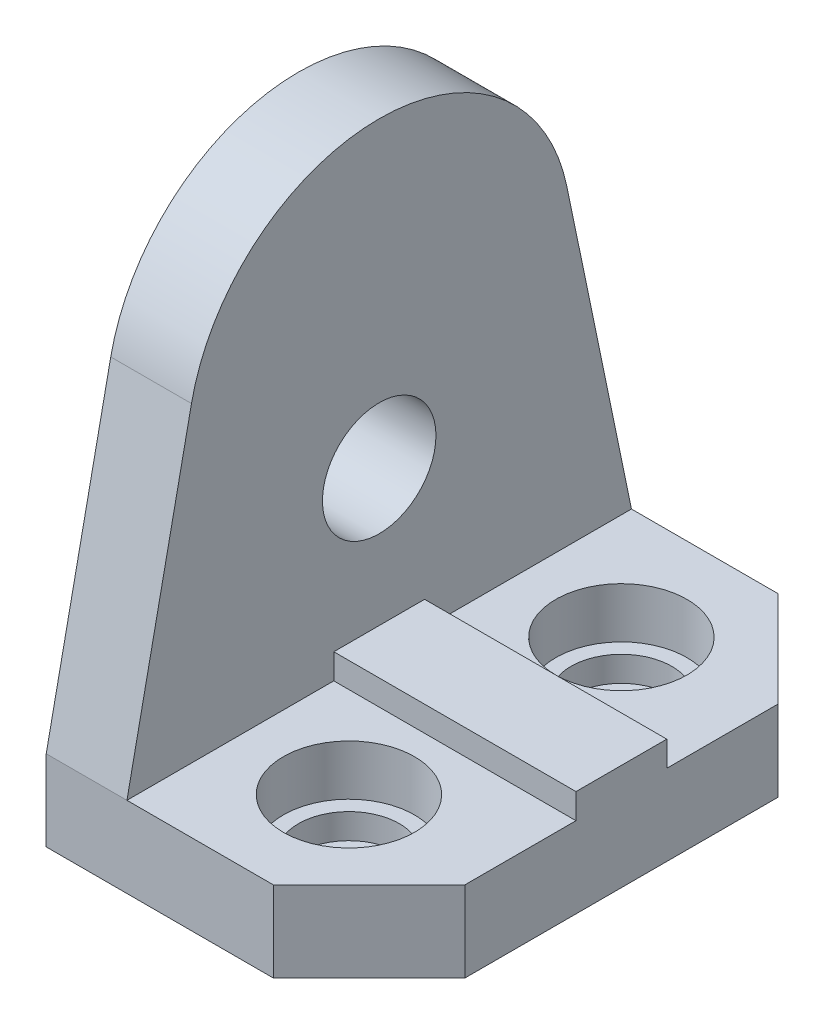
ISO-10303-21;
HEADER;
FILE_DESCRIPTION(('STEP AP214'),'2;1');
FILE_NAME('part.step','',(''),(''),'','','');
FILE_SCHEMA(('AUTOMOTIVE_DESIGN { 1 0 10303 214 1 1 1 1 }'));
ENDSEC;
DATA;
#1=APPLICATION_CONTEXT('core data for automotive mechanical design processes');
#2=APPLICATION_PROTOCOL_DEFINITION('international standard','automotive_design',2000,#1);
#3=PRODUCT_CONTEXT('',#1,'mechanical');
#4=PRODUCT('Part','Part','',(#3));
#5=PRODUCT_RELATED_PRODUCT_CATEGORY('part','',(#4));
#6=PRODUCT_DEFINITION_FORMATION('','',#4);
#7=PRODUCT_DEFINITION_CONTEXT('part definition',#1,'design');
#8=PRODUCT_DEFINITION('design','',#6,#7);
#9=PRODUCT_DEFINITION_SHAPE('','',#8);
#10=(LENGTH_UNIT() NAMED_UNIT(*) SI_UNIT(.MILLI.,.METRE.));
#11=(NAMED_UNIT(*) PLANE_ANGLE_UNIT() SI_UNIT($,.RADIAN.));
#12=(NAMED_UNIT(*) SI_UNIT($,.STERADIAN.) SOLID_ANGLE_UNIT());
#13=UNCERTAINTY_MEASURE_WITH_UNIT(LENGTH_MEASURE(1.E-05),#10,'distance_accuracy_value','');
#14=(GEOMETRIC_REPRESENTATION_CONTEXT(3) GLOBAL_UNCERTAINTY_ASSIGNED_CONTEXT((#13)) GLOBAL_UNIT_ASSIGNED_CONTEXT((#10,
#11,#12)) REPRESENTATION_CONTEXT('',''));
#15=CARTESIAN_POINT('',(0.,0.,0.));
#16=DIRECTION('',(0.,0.,1.));
#17=DIRECTION('',(1.,0.,0.));
#18=AXIS2_PLACEMENT_3D('',#15,#16,#17);
#19=CARTESIAN_POINT('',(0.,32.,0.));
#20=DIRECTION('',(0.,1.,0.));
#21=DIRECTION('',(0.,0.,1.));
#22=AXIS2_PLACEMENT_3D('',#19,#20,#21);
#23=PLANE('',#22);
#24=CARTESIAN_POINT('',(74.,32.,54.));
#25=DIRECTION('',(0.,1.,0.));
#26=DIRECTION('',(0.,0.,1.));
#27=AXIS2_PLACEMENT_3D('',#24,#25,#26);
#28=CIRCLE('',#27,26.);
#29=CARTESIAN_POINT('',(74.,32.,80.));
#30=VERTEX_POINT('',#29);
#31=EDGE_CURVE('E133',#30,#30,#28,.T.);
#32=ORIENTED_EDGE('',*,*,#31,.F.);
#33=EDGE_LOOP('',(#32));
#34=FACE_BOUND('',#33,.T.);
#35=DIRECTION('',(1.,0.,0.));
#36=VECTOR('',#35,1.);
#37=CARTESIAN_POINT('',(0.,32.,18.));
#38=LINE('',#37,#36);
#39=CARTESIAN_POINT('',(32.,32.,18.));
#40=VERTEX_POINT('',#39);
#41=CARTESIAN_POINT('',(128.,32.,18.));
#42=VERTEX_POINT('',#41);
#43=EDGE_CURVE('E113',#40,#42,#38,.T.);
#44=ORIENTED_EDGE('',*,*,#43,.F.);
#45=DIRECTION('',(0.,0.,-1.));
#46=VECTOR('',#45,1.);
#47=CARTESIAN_POINT('',(32.,32.,100.));
#48=LINE('',#47,#46);
#49=CARTESIAN_POINT('',(32.,32.,100.));
#50=VERTEX_POINT('',#49);
#51=EDGE_CURVE('E167',#50,#40,#48,.T.);
#52=ORIENTED_EDGE('',*,*,#51,.F.);
#53=DIRECTION('',(1.,0.,0.));
#54=VECTOR('',#53,1.);
#55=CARTESIAN_POINT('',(0.,32.,100.));
#56=LINE('',#55,#54);
#57=CARTESIAN_POINT('',(90.,32.,100.));
#58=VERTEX_POINT('',#57);
#59=EDGE_CURVE('E117',#50,#58,#56,.T.);
#60=ORIENTED_EDGE('',*,*,#59,.T.);
#61=DIRECTION('',(0.707106781186548,0.,-0.707106781186547));
#62=VECTOR('',#61,1.);
#63=CARTESIAN_POINT('',(95.,32.,95.0000000000001));
#64=LINE('',#63,#62);
#65=CARTESIAN_POINT('',(128.,32.,62.));
#66=VERTEX_POINT('',#65);
#67=EDGE_CURVE('E66',#58,#66,#64,.T.);
#68=ORIENTED_EDGE('',*,*,#67,.T.);
#69=DIRECTION('',(0.,0.,1.));
#70=VECTOR('',#69,1.);
#71=CARTESIAN_POINT('',(128.,32.,0.));
#72=LINE('',#71,#70);
#73=EDGE_CURVE('E91',#42,#66,#72,.T.);
#74=ORIENTED_EDGE('',*,*,#73,.F.);
#75=EDGE_LOOP('',(#44,#52,#60,#68,#74));
#76=FACE_BOUND('',#75,.T.);
#77=ADVANCED_FACE('F39',(#34,#76),#23,.T.);
#78=CARTESIAN_POINT('',(0.,42.,18.));
#79=DIRECTION('',(0.,0.,-1.));
#80=DIRECTION('',(-1.,0.,0.));
#81=AXIS2_PLACEMENT_3D('',#78,#79,#80);
#82=PLANE('',#81);
#83=DIRECTION('',(0.,1.,0.));
#84=VECTOR('',#83,1.);
#85=CARTESIAN_POINT('',(32.,42.,18.));
#86=LINE('',#85,#84);
#87=CARTESIAN_POINT('',(32.,42.,18.));
#88=VERTEX_POINT('',#87);
#89=EDGE_CURVE('E208',#40,#88,#86,.T.);
#90=ORIENTED_EDGE('',*,*,#89,.F.);
#91=ORIENTED_EDGE('',*,*,#43,.T.);
#92=DIRECTION('',(0.,-1.,0.));
#93=VECTOR('',#92,1.);
#94=CARTESIAN_POINT('',(128.,42.,18.));
#95=LINE('',#94,#93);
#96=CARTESIAN_POINT('',(128.,42.,18.));
#97=VERTEX_POINT('',#96);
#98=EDGE_CURVE('E261',#97,#42,#95,.T.);
#99=ORIENTED_EDGE('',*,*,#98,.F.);
#100=DIRECTION('',(1.,0.,0.));
#101=VECTOR('',#100,1.);
#102=CARTESIAN_POINT('',(0.,42.,18.));
#103=LINE('',#102,#101);
#104=EDGE_CURVE('E249',#88,#97,#103,.T.);
#105=ORIENTED_EDGE('',*,*,#104,.F.);
#106=EDGE_LOOP('',(#90,#91,#99,#105));
#107=FACE_BOUND('',#106,.T.);
#108=ADVANCED_FACE('F311',(#107),#82,.F.);
#109=CARTESIAN_POINT('',(0.,42.,-18.));
#110=DIRECTION('',(0.,0.,-1.));
#111=DIRECTION('',(-1.,0.,0.));
#112=AXIS2_PLACEMENT_3D('',#109,#110,#111);
#113=PLANE('',#112);
#114=DIRECTION('',(1.,0.,0.));
#115=VECTOR('',#114,1.);
#116=CARTESIAN_POINT('',(0.,32.,-18.));
#117=LINE('',#116,#115);
#118=CARTESIAN_POINT('',(32.,32.,-18.));
#119=VERTEX_POINT('',#118);
#120=CARTESIAN_POINT('',(128.,32.,-18.));
#121=VERTEX_POINT('',#120);
#122=EDGE_CURVE('E212',#119,#121,#117,.T.);
#123=ORIENTED_EDGE('',*,*,#122,.F.);
#124=DIRECTION('',(0.,1.,0.));
#125=VECTOR('',#124,1.);
#126=CARTESIAN_POINT('',(32.,42.,-18.));
#127=LINE('',#126,#125);
#128=CARTESIAN_POINT('',(32.,42.,-18.));
#129=VERTEX_POINT('',#128);
#130=EDGE_CURVE('E204',#119,#129,#127,.T.);
#131=ORIENTED_EDGE('',*,*,#130,.T.);
#132=DIRECTION('',(1.,0.,0.));
#133=VECTOR('',#132,1.);
#134=CARTESIAN_POINT('',(0.,42.,-18.));
#135=LINE('',#134,#133);
#136=CARTESIAN_POINT('',(128.,42.,-18.));
#137=VERTEX_POINT('',#136);
#138=EDGE_CURVE('E245',#129,#137,#135,.T.);
#139=ORIENTED_EDGE('',*,*,#138,.T.);
#140=DIRECTION('',(0.,-1.,0.));
#141=VECTOR('',#140,1.);
#142=CARTESIAN_POINT('',(128.,42.,-18.));
#143=LINE('',#142,#141);
#144=EDGE_CURVE('E257',#137,#121,#143,.T.);
#145=ORIENTED_EDGE('',*,*,#144,.T.);
#146=EDGE_LOOP('',(#123,#131,#139,#145));
#147=FACE_BOUND('',#146,.T.);
#148=ADVANCED_FACE('F340',(#147),#113,.T.);
#149=CARTESIAN_POINT('',(0.,42.,0.));
#150=DIRECTION('',(0.,1.,0.));
#151=DIRECTION('',(0.,0.,1.));
#152=AXIS2_PLACEMENT_3D('',#149,#150,#151);
#153=PLANE('',#152);
#154=ORIENTED_EDGE('',*,*,#138,.F.);
#155=DIRECTION('',(0.,0.,1.));
#156=VECTOR('',#155,1.);
#157=CARTESIAN_POINT('',(32.,42.,0.));
#158=LINE('',#157,#156);
#159=EDGE_CURVE('E200',#129,#88,#158,.T.);
#160=ORIENTED_EDGE('',*,*,#159,.T.);
#161=ORIENTED_EDGE('',*,*,#104,.T.);
#162=DIRECTION('',(0.,0.,1.));
#163=VECTOR('',#162,1.);
#164=CARTESIAN_POINT('',(128.,42.,0.));
#165=LINE('',#164,#163);
#166=EDGE_CURVE('E253',#137,#97,#165,.T.);
#167=ORIENTED_EDGE('',*,*,#166,.F.);
#168=EDGE_LOOP('',(#154,#160,#161,#167));
#169=FACE_BOUND('',#168,.T.);
#170=ADVANCED_FACE('F319',(#169),#153,.T.);
#171=CARTESIAN_POINT('',(0.,32.,0.));
#172=DIRECTION('',(0.,1.,0.));
#173=DIRECTION('',(0.,0.,1.));
#174=AXIS2_PLACEMENT_3D('',#171,#172,#173);
#175=PLANE('',#174);
#176=CARTESIAN_POINT('',(74.,32.,-54.));
#177=DIRECTION('',(0.,1.,0.));
#178=DIRECTION('',(0.,0.,1.));
#179=AXIS2_PLACEMENT_3D('',#176,#177,#178);
#180=CIRCLE('',#179,26.);
#181=CARTESIAN_POINT('',(74.,32.,-28.));
#182=VERTEX_POINT('',#181);
#183=EDGE_CURVE('E148',#182,#182,#180,.T.);
#184=ORIENTED_EDGE('',*,*,#183,.F.);
#185=EDGE_LOOP('',(#184));
#186=FACE_BOUND('',#185,.T.);
#187=DIRECTION('',(1.,0.,0.));
#188=VECTOR('',#187,1.);
#189=CARTESIAN_POINT('',(0.,32.,-100.));
#190=LINE('',#189,#188);
#191=CARTESIAN_POINT('',(32.,32.,-100.));
#192=VERTEX_POINT('',#191);
#193=CARTESIAN_POINT('',(90.,32.,-100.));
#194=VERTEX_POINT('',#193);
#195=EDGE_CURVE('E225',#192,#194,#190,.T.);
#196=ORIENTED_EDGE('',*,*,#195,.F.);
#197=DIRECTION('',(0.,0.,1.));
#198=VECTOR('',#197,1.);
#199=CARTESIAN_POINT('',(32.,32.,0.));
#200=LINE('',#199,#198);
#201=EDGE_CURVE('E11',#192,#119,#200,.T.);
#202=ORIENTED_EDGE('',*,*,#201,.T.);
#203=ORIENTED_EDGE('',*,*,#122,.T.);
#204=DIRECTION('',(0.,0.,1.));
#205=VECTOR('',#204,1.);
#206=CARTESIAN_POINT('',(128.,32.,0.));
#207=LINE('',#206,#205);
#208=CARTESIAN_POINT('',(128.,32.,-62.));
#209=VERTEX_POINT('',#208);
#210=EDGE_CURVE('E216',#209,#121,#207,.T.);
#211=ORIENTED_EDGE('',*,*,#210,.F.);
#212=DIRECTION('',(0.707106781186548,0.,0.707106781186547));
#213=VECTOR('',#212,1.);
#214=CARTESIAN_POINT('',(95.,32.,-95.0000000000001));
#215=LINE('',#214,#213);
#216=EDGE_CURVE('E221',#194,#209,#215,.T.);
#217=ORIENTED_EDGE('',*,*,#216,.F.);
#218=EDGE_LOOP('',(#196,#202,#203,#211,#217));
#219=FACE_BOUND('',#218,.T.);
#220=ADVANCED_FACE('F337',(#186,#219),#175,.T.);
#221=CARTESIAN_POINT('',(0.,32.,0.));
#222=DIRECTION('',(-1.,0.,0.));
#223=DIRECTION('',(0.,0.,1.));
#224=AXIS2_PLACEMENT_3D('',#221,#222,#223);
#225=PLANE('',#224);
#226=DIRECTION('',(0.,-1.,0.));
#227=VECTOR('',#226,1.);
#228=CARTESIAN_POINT('',(0.,32.,100.));
#229=LINE('',#228,#227);
#230=CARTESIAN_POINT('',(0.,32.,100.));
#231=VERTEX_POINT('',#230);
#232=CARTESIAN_POINT('',(0.,0.,100.));
#233=VERTEX_POINT('',#232);
#234=EDGE_CURVE('E49',#231,#233,#229,.T.);
#235=ORIENTED_EDGE('',*,*,#234,.F.);
#236=DIRECTION('',(0.,-0.979188602552283,0.202952409770633));
#237=VECTOR('',#236,1.);
#238=CARTESIAN_POINT('',(0.,32.,100.));
#239=LINE('',#238,#237);
#240=CARTESIAN_POINT('',(0.,155.424383142568,74.4183337939735));
#241=VERTEX_POINT('',#240);
#242=EDGE_CURVE('E171',#241,#231,#239,.T.);
#243=ORIENTED_EDGE('',*,*,#242,.F.);
#244=CARTESIAN_POINT('',(0.,140.,0.));
#245=DIRECTION('',(1.,0.,0.));
#246=DIRECTION('',(0.,0.,1.));
#247=AXIS2_PLACEMENT_3D('',#244,#245,#246);
#248=CIRCLE('',#247,76.);
#249=CARTESIAN_POINT('',(0.,155.424383142568,-74.4183337939735));
#250=VERTEX_POINT('',#249);
#251=EDGE_CURVE('E186',#250,#241,#248,.T.);
#252=ORIENTED_EDGE('',*,*,#251,.F.);
#253=DIRECTION('',(0.,0.979188602552283,0.202952409770633));
#254=VECTOR('',#253,1.);
#255=CARTESIAN_POINT('',(0.,155.424383142568,-74.4183337939735));
#256=LINE('',#255,#254);
#257=CARTESIAN_POINT('',(0.,32.,-100.));
#258=VERTEX_POINT('',#257);
#259=EDGE_CURVE('E163',#258,#250,#256,.T.);
#260=ORIENTED_EDGE('',*,*,#259,.F.);
#261=DIRECTION('',(0.,-1.,0.));
#262=VECTOR('',#261,1.);
#263=CARTESIAN_POINT('',(0.,32.,-100.));
#264=LINE('',#263,#262);
#265=CARTESIAN_POINT('',(0.,0.,-100.));
#266=VERTEX_POINT('',#265);
#267=EDGE_CURVE('E230',#258,#266,#264,.T.);
#268=ORIENTED_EDGE('',*,*,#267,.T.);
#269=DIRECTION('',(0.,0.,-1.));
#270=VECTOR('',#269,1.);
#271=CARTESIAN_POINT('',(0.,0.,0.));
#272=LINE('',#271,#270);
#273=EDGE_CURVE('E263',#233,#266,#272,.T.);
#274=ORIENTED_EDGE('',*,*,#273,.F.);
#275=EDGE_LOOP('',(#235,#243,#252,#260,#268,#274));
#276=FACE_BOUND('',#275,.T.);
#277=CARTESIAN_POINT('',(0.,96.,0.));
#278=DIRECTION('',(1.,0.,0.));
#279=DIRECTION('',(0.,0.,-1.));
#280=AXIS2_PLACEMENT_3D('',#277,#278,#279);
#281=CIRCLE('',#280,22.5);
#282=CARTESIAN_POINT('',(0.,96.,-22.5));
#283=VERTEX_POINT('',#282);
#284=EDGE_CURVE('E147',#283,#283,#281,.T.);
#285=ORIENTED_EDGE('',*,*,#284,.T.);
#286=EDGE_LOOP('',(#285));
#287=FACE_BOUND('',#286,.T.);
#288=ADVANCED_FACE('F41',(#276,#287),#225,.T.);
#289=CARTESIAN_POINT('',(0.,32.,100.));
#290=DIRECTION('',(0.,0.,-1.));
#291=DIRECTION('',(-1.,0.,0.));
#292=AXIS2_PLACEMENT_3D('',#289,#290,#291);
#293=PLANE('',#292);
#294=DIRECTION('',(1.,0.,0.));
#295=VECTOR('',#294,1.);
#296=CARTESIAN_POINT('',(0.,0.,100.));
#297=LINE('',#296,#295);
#298=CARTESIAN_POINT('',(90.,0.,100.));
#299=VERTEX_POINT('',#298);
#300=EDGE_CURVE('E104',#233,#299,#297,.T.);
#301=ORIENTED_EDGE('',*,*,#300,.T.);
#302=DIRECTION('',(0.,-1.,0.));
#303=VECTOR('',#302,1.);
#304=CARTESIAN_POINT('',(90.,32.,100.));
#305=LINE('',#304,#303);
#306=EDGE_CURVE('E94',#58,#299,#305,.T.);
#307=ORIENTED_EDGE('',*,*,#306,.F.);
#308=ORIENTED_EDGE('',*,*,#59,.F.);
#309=EDGE_CURVE('E265',#231,#50,#56,.T.);
#310=ORIENTED_EDGE('',*,*,#309,.F.);
#311=ORIENTED_EDGE('',*,*,#234,.T.);
#312=EDGE_LOOP('',(#301,#307,#308,#310,#311));
#313=FACE_BOUND('',#312,.T.);
#314=ADVANCED_FACE('F276',(#313),#293,.F.);
#315=CARTESIAN_POINT('',(95.,32.,95.0000000000001));
#316=DIRECTION('',(-0.707106781186547,0.,-0.707106781186548));
#317=DIRECTION('',(-0.707106781186548,0.,0.707106781186547));
#318=AXIS2_PLACEMENT_3D('',#315,#316,#317);
#319=PLANE('',#318);
#320=DIRECTION('',(0.707106781186548,0.,-0.707106781186547));
#321=VECTOR('',#320,1.);
#322=CARTESIAN_POINT('',(95.,0.,95.0000000000001));
#323=LINE('',#322,#321);
#324=CARTESIAN_POINT('',(128.,0.,62.));
#325=VERTEX_POINT('',#324);
#326=EDGE_CURVE('E98',#299,#325,#323,.T.);
#327=ORIENTED_EDGE('',*,*,#326,.T.);
#328=DIRECTION('',(0.,-1.,0.));
#329=VECTOR('',#328,1.);
#330=CARTESIAN_POINT('',(128.,32.,62.));
#331=LINE('',#330,#329);
#332=EDGE_CURVE('E82',#66,#325,#331,.T.);
#333=ORIENTED_EDGE('',*,*,#332,.F.);
#334=ORIENTED_EDGE('',*,*,#67,.F.);
#335=ORIENTED_EDGE('',*,*,#306,.T.);
#336=EDGE_LOOP('',(#327,#333,#334,#335));
#337=FACE_BOUND('',#336,.T.);
#338=ADVANCED_FACE('F99',(#337),#319,.F.);
#339=CARTESIAN_POINT('',(128.,32.,0.));
#340=DIRECTION('',(1.,0.,0.));
#341=DIRECTION('',(0.,0.,-1.));
#342=AXIS2_PLACEMENT_3D('',#339,#340,#341);
#343=PLANE('',#342);
#344=DIRECTION('',(0.,0.,1.));
#345=VECTOR('',#344,1.);
#346=CARTESIAN_POINT('',(128.,0.,0.));
#347=LINE('',#346,#345);
#348=CARTESIAN_POINT('',(128.,0.,-62.));
#349=VERTEX_POINT('',#348);
#350=EDGE_CURVE('E88',#349,#325,#347,.T.);
#351=ORIENTED_EDGE('',*,*,#350,.F.);
#352=DIRECTION('',(0.,-1.,0.));
#353=VECTOR('',#352,1.);
#354=CARTESIAN_POINT('',(128.,32.,-62.));
#355=LINE('',#354,#353);
#356=EDGE_CURVE('E242',#209,#349,#355,.T.);
#357=ORIENTED_EDGE('',*,*,#356,.F.);
#358=ORIENTED_EDGE('',*,*,#210,.T.);
#359=ORIENTED_EDGE('',*,*,#144,.F.);
#360=ORIENTED_EDGE('',*,*,#166,.T.);
#361=ORIENTED_EDGE('',*,*,#98,.T.);
#362=ORIENTED_EDGE('',*,*,#73,.T.);
#363=ORIENTED_EDGE('',*,*,#332,.T.);
#364=EDGE_LOOP('',(#351,#357,#358,#359,#360,#361,#362,#363));
#365=FACE_BOUND('',#364,.T.);
#366=ADVANCED_FACE('F84',(#365),#343,.T.);
#367=CARTESIAN_POINT('',(0.,0.,0.));
#368=DIRECTION('',(0.,1.,0.));
#369=DIRECTION('',(0.,0.,1.));
#370=AXIS2_PLACEMENT_3D('',#367,#368,#369);
#371=PLANE('',#370);
#372=ORIENTED_EDGE('',*,*,#273,.T.);
#373=DIRECTION('',(1.,0.,0.));
#374=VECTOR('',#373,1.);
#375=CARTESIAN_POINT('',(0.,0.,-100.));
#376=LINE('',#375,#374);
#377=CARTESIAN_POINT('',(90.,0.,-100.));
#378=VERTEX_POINT('',#377);
#379=EDGE_CURVE('E217',#266,#378,#376,.T.);
#380=ORIENTED_EDGE('',*,*,#379,.T.);
#381=DIRECTION('',(0.707106781186548,0.,0.707106781186547));
#382=VECTOR('',#381,1.);
#383=CARTESIAN_POINT('',(95.,0.,-95.0000000000001));
#384=LINE('',#383,#382);
#385=EDGE_CURVE('E111',#378,#349,#384,.T.);
#386=ORIENTED_EDGE('',*,*,#385,.T.);
#387=ORIENTED_EDGE('',*,*,#350,.T.);
#388=ORIENTED_EDGE('',*,*,#326,.F.);
#389=ORIENTED_EDGE('',*,*,#300,.F.);
#390=EDGE_LOOP('',(#372,#380,#386,#387,#388,#389));
#391=FACE_BOUND('',#390,.T.);
#392=ADVANCED_FACE('F108',(#391),#371,.F.);
#393=CARTESIAN_POINT('',(95.,32.,-95.0000000000001));
#394=DIRECTION('',(0.707106781186547,0.,-0.707106781186548));
#395=DIRECTION('',(-0.707106781186548,0.,-0.707106781186547));
#396=AXIS2_PLACEMENT_3D('',#393,#394,#395);
#397=PLANE('',#396);
#398=ORIENTED_EDGE('',*,*,#385,.F.);
#399=DIRECTION('',(0.,-1.,0.));
#400=VECTOR('',#399,1.);
#401=CARTESIAN_POINT('',(90.,32.,-100.));
#402=LINE('',#401,#400);
#403=EDGE_CURVE('E238',#194,#378,#402,.T.);
#404=ORIENTED_EDGE('',*,*,#403,.F.);
#405=ORIENTED_EDGE('',*,*,#216,.T.);
#406=ORIENTED_EDGE('',*,*,#356,.T.);
#407=EDGE_LOOP('',(#398,#404,#405,#406));
#408=FACE_BOUND('',#407,.T.);
#409=ADVANCED_FACE('F335',(#408),#397,.T.);
#410=CARTESIAN_POINT('',(0.,32.,-100.));
#411=DIRECTION('',(0.,0.,-1.));
#412=DIRECTION('',(-1.,0.,0.));
#413=AXIS2_PLACEMENT_3D('',#410,#411,#412);
#414=PLANE('',#413);
#415=ORIENTED_EDGE('',*,*,#379,.F.);
#416=ORIENTED_EDGE('',*,*,#267,.F.);
#417=EDGE_CURVE('E226',#258,#192,#190,.T.);
#418=ORIENTED_EDGE('',*,*,#417,.T.);
#419=ORIENTED_EDGE('',*,*,#195,.T.);
#420=ORIENTED_EDGE('',*,*,#403,.T.);
#421=EDGE_LOOP('',(#415,#416,#418,#419,#420));
#422=FACE_BOUND('',#421,.T.);
#423=ADVANCED_FACE('F295',(#422),#414,.T.);
#424=CARTESIAN_POINT('',(32.,140.,0.));
#425=DIRECTION('',(-1.,0.,0.));
#426=DIRECTION('',(0.,0.,1.));
#427=AXIS2_PLACEMENT_3D('',#424,#425,#426);
#428=PLANE('',#427);
#429=CARTESIAN_POINT('',(32.,96.,0.));
#430=DIRECTION('',(1.,0.,0.));
#431=DIRECTION('',(0.,0.,-1.));
#432=AXIS2_PLACEMENT_3D('',#429,#430,#431);
#433=CIRCLE('',#432,22.5);
#434=CARTESIAN_POINT('',(32.,96.,-22.5));
#435=VERTEX_POINT('',#434);
#436=EDGE_CURVE('E159',#435,#435,#433,.T.);
#437=ORIENTED_EDGE('',*,*,#436,.F.);
#438=EDGE_LOOP('',(#437));
#439=FACE_BOUND('',#438,.T.);
#440=ORIENTED_EDGE('',*,*,#51,.T.);
#441=ORIENTED_EDGE('',*,*,#89,.T.);
#442=ORIENTED_EDGE('',*,*,#159,.F.);
#443=ORIENTED_EDGE('',*,*,#130,.F.);
#444=ORIENTED_EDGE('',*,*,#201,.F.);
#445=DIRECTION('',(0.,0.979188602552283,0.202952409770633));
#446=VECTOR('',#445,1.);
#447=CARTESIAN_POINT('',(32.,155.424383142568,-74.4183337939735));
#448=LINE('',#447,#446);
#449=CARTESIAN_POINT('',(32.,155.424383142568,-74.4183337939735));
#450=VERTEX_POINT('',#449);
#451=EDGE_CURVE('E57',#192,#450,#448,.T.);
#452=ORIENTED_EDGE('',*,*,#451,.T.);
#453=CARTESIAN_POINT('',(32.,140.,0.));
#454=DIRECTION('',(1.,0.,0.));
#455=DIRECTION('',(0.,0.,1.));
#456=AXIS2_PLACEMENT_3D('',#453,#454,#455);
#457=CIRCLE('',#456,76.);
#458=CARTESIAN_POINT('',(32.,155.424383142568,74.4183337939735));
#459=VERTEX_POINT('',#458);
#460=EDGE_CURVE('E174',#450,#459,#457,.T.);
#461=ORIENTED_EDGE('',*,*,#460,.T.);
#462=DIRECTION('',(0.,-0.979188602552283,0.202952409770633));
#463=VECTOR('',#462,1.);
#464=CARTESIAN_POINT('',(32.,32.,100.));
#465=LINE('',#464,#463);
#466=EDGE_CURVE('E178',#459,#50,#465,.T.);
#467=ORIENTED_EDGE('',*,*,#466,.T.);
#468=EDGE_LOOP('',(#440,#441,#442,#443,#444,#452,#461,#467));
#469=FACE_BOUND('',#468,.T.);
#470=ADVANCED_FACE('F342',(#439,#469),#428,.F.);
#471=CARTESIAN_POINT('',(32.,155.424383142568,-74.4183337939735));
#472=DIRECTION('',(0.,-0.202952409770633,0.979188602552283));
#473=DIRECTION('',(0.,-0.979188602552283,-0.202952409770633));
#474=AXIS2_PLACEMENT_3D('',#471,#472,#473);
#475=PLANE('',#474);
#476=ORIENTED_EDGE('',*,*,#259,.T.);
#477=DIRECTION('',(-1.,0.,0.));
#478=VECTOR('',#477,1.);
#479=CARTESIAN_POINT('',(32.,155.424383142568,-74.4183337939735));
#480=LINE('',#479,#478);
#481=EDGE_CURVE('E196',#450,#250,#480,.T.);
#482=ORIENTED_EDGE('',*,*,#481,.F.);
#483=ORIENTED_EDGE('',*,*,#451,.F.);
#484=ORIENTED_EDGE('',*,*,#417,.F.);
#485=EDGE_LOOP('',(#476,#482,#483,#484));
#486=FACE_BOUND('',#485,.T.);
#487=ADVANCED_FACE('F358',(#486),#475,.F.);
#488=CARTESIAN_POINT('',(32.,140.,0.));
#489=DIRECTION('',(-1.,0.,0.));
#490=DIRECTION('',(0.,0.,1.));
#491=AXIS2_PLACEMENT_3D('',#488,#489,#490);
#492=CYLINDRICAL_SURFACE('',#491,76.);
#493=ORIENTED_EDGE('',*,*,#251,.T.);
#494=DIRECTION('',(-1.,0.,0.));
#495=VECTOR('',#494,1.);
#496=CARTESIAN_POINT('',(32.,155.424383142568,74.4183337939735));
#497=LINE('',#496,#495);
#498=EDGE_CURVE('E182',#459,#241,#497,.T.);
#499=ORIENTED_EDGE('',*,*,#498,.F.);
#500=ORIENTED_EDGE('',*,*,#460,.F.);
#501=ORIENTED_EDGE('',*,*,#481,.T.);
#502=EDGE_LOOP('',(#493,#499,#500,#501));
#503=FACE_BOUND('',#502,.T.);
#504=ADVANCED_FACE('F360',(#503),#492,.T.);
#505=CARTESIAN_POINT('',(32.,32.,100.));
#506=DIRECTION('',(0.,-0.202952409770633,-0.979188602552283));
#507=DIRECTION('',(0.,0.979188602552283,-0.202952409770633));
#508=AXIS2_PLACEMENT_3D('',#505,#506,#507);
#509=PLANE('',#508);
#510=ORIENTED_EDGE('',*,*,#242,.T.);
#511=ORIENTED_EDGE('',*,*,#309,.T.);
#512=ORIENTED_EDGE('',*,*,#466,.F.);
#513=ORIENTED_EDGE('',*,*,#498,.T.);
#514=EDGE_LOOP('',(#510,#511,#512,#513));
#515=FACE_BOUND('',#514,.T.);
#516=ADVANCED_FACE('F363',(#515),#509,.F.);
#517=CARTESIAN_POINT('',(32.,96.,0.));
#518=DIRECTION('',(-1.,0.,0.));
#519=DIRECTION('',(0.,0.,1.));
#520=AXIS2_PLACEMENT_3D('',#517,#518,#519);
#521=CYLINDRICAL_SURFACE('',#520,22.5);
#522=ORIENTED_EDGE('',*,*,#436,.T.);
#523=EDGE_LOOP('',(#522));
#524=FACE_BOUND('',#523,.T.);
#525=ORIENTED_EDGE('',*,*,#284,.F.);
#526=EDGE_LOOP('',(#525));
#527=FACE_BOUND('',#526,.T.);
#528=ADVANCED_FACE('F366',(#524,#527),#521,.F.);
#529=CARTESIAN_POINT('',(74.,12.,-54.));
#530=DIRECTION('',(0.,1.,0.));
#531=DIRECTION('',(0.,0.,1.));
#532=AXIS2_PLACEMENT_3D('',#529,#530,#531);
#533=CYLINDRICAL_SURFACE('',#532,26.);
#534=CARTESIAN_POINT('',(74.,12.,-54.));
#535=DIRECTION('',(0.,1.,0.));
#536=DIRECTION('',(0.,0.,1.));
#537=AXIS2_PLACEMENT_3D('',#534,#535,#536);
#538=CIRCLE('',#537,26.);
#539=CARTESIAN_POINT('',(74.,12.,-28.));
#540=VERTEX_POINT('',#539);
#541=EDGE_CURVE('E143',#540,#540,#538,.T.);
#542=ORIENTED_EDGE('',*,*,#541,.F.);
#543=EDGE_LOOP('',(#542));
#544=FACE_BOUND('',#543,.T.);
#545=ORIENTED_EDGE('',*,*,#183,.T.);
#546=EDGE_LOOP('',(#545));
#547=FACE_BOUND('',#546,.T.);
#548=ADVANCED_FACE('F372',(#544,#547),#533,.F.);
#549=CARTESIAN_POINT('',(0.,12.,0.));
#550=DIRECTION('',(0.,1.,0.));
#551=DIRECTION('',(0.,0.,1.));
#552=AXIS2_PLACEMENT_3D('',#549,#550,#551);
#553=PLANE('',#552);
#554=CARTESIAN_POINT('',(74.,12.,-54.));
#555=DIRECTION('',(0.,1.,0.));
#556=DIRECTION('',(0.,0.,1.));
#557=AXIS2_PLACEMENT_3D('',#554,#555,#556);
#558=CIRCLE('',#557,20.);
#559=CARTESIAN_POINT('',(74.,12.,-34.));
#560=VERTEX_POINT('',#559);
#561=EDGE_CURVE('E43',#560,#560,#558,.T.);
#562=ORIENTED_EDGE('',*,*,#561,.F.);
#563=EDGE_LOOP('',(#562));
#564=FACE_BOUND('',#563,.T.);
#565=ORIENTED_EDGE('',*,*,#541,.T.);
#566=EDGE_LOOP('',(#565));
#567=FACE_BOUND('',#566,.T.);
#568=ADVANCED_FACE('F466',(#564,#567),#553,.T.);
#569=CARTESIAN_POINT('',(74.,12.,54.));
#570=DIRECTION('',(0.,1.,0.));
#571=DIRECTION('',(0.,0.,1.));
#572=AXIS2_PLACEMENT_3D('',#569,#570,#571);
#573=CYLINDRICAL_SURFACE('',#572,26.);
#574=CARTESIAN_POINT('',(74.,12.,54.));
#575=DIRECTION('',(0.,1.,0.));
#576=DIRECTION('',(0.,0.,1.));
#577=AXIS2_PLACEMENT_3D('',#574,#575,#576);
#578=CIRCLE('',#577,26.);
#579=CARTESIAN_POINT('',(74.,12.,80.));
#580=VERTEX_POINT('',#579);
#581=EDGE_CURVE('E152',#580,#580,#578,.T.);
#582=ORIENTED_EDGE('',*,*,#581,.F.);
#583=EDGE_LOOP('',(#582));
#584=FACE_BOUND('',#583,.T.);
#585=ORIENTED_EDGE('',*,*,#31,.T.);
#586=EDGE_LOOP('',(#585));
#587=FACE_BOUND('',#586,.T.);
#588=ADVANCED_FACE('F474',(#584,#587),#573,.F.);
#589=CARTESIAN_POINT('',(0.,12.,0.));
#590=DIRECTION('',(0.,1.,0.));
#591=DIRECTION('',(0.,0.,1.));
#592=AXIS2_PLACEMENT_3D('',#589,#590,#591);
#593=PLANE('',#592);
#594=CARTESIAN_POINT('',(74.,12.,54.));
#595=DIRECTION('',(0.,1.,0.));
#596=DIRECTION('',(0.,0.,1.));
#597=AXIS2_PLACEMENT_3D('',#594,#595,#596);
#598=CIRCLE('',#597,20.);
#599=CARTESIAN_POINT('',(74.,12.,74.));
#600=VERTEX_POINT('',#599);
#601=EDGE_CURVE('E124',#600,#600,#598,.T.);
#602=ORIENTED_EDGE('',*,*,#601,.F.);
#603=EDGE_LOOP('',(#602));
#604=FACE_BOUND('',#603,.T.);
#605=ORIENTED_EDGE('',*,*,#581,.T.);
#606=EDGE_LOOP('',(#605));
#607=FACE_BOUND('',#606,.T.);
#608=ADVANCED_FACE('F479',(#604,#607),#593,.T.);
#609=CARTESIAN_POINT('',(74.,2.,54.));
#610=DIRECTION('',(0.,1.,0.));
#611=DIRECTION('',(0.,0.,1.));
#612=AXIS2_PLACEMENT_3D('',#609,#610,#611);
#613=CYLINDRICAL_SURFACE('',#612,20.);
#614=ORIENTED_EDGE('',*,*,#601,.T.);
#615=EDGE_LOOP('',(#614));
#616=FACE_BOUND('',#615,.T.);
#617=CARTESIAN_POINT('',(74.,2.,54.));
#618=DIRECTION('',(0.,1.,0.));
#619=DIRECTION('',(0.,0.,1.));
#620=AXIS2_PLACEMENT_3D('',#617,#618,#619);
#621=CIRCLE('',#620,20.);
#622=CARTESIAN_POINT('',(74.,2.,74.));
#623=VERTEX_POINT('',#622);
#624=EDGE_CURVE('E135',#623,#623,#621,.T.);
#625=ORIENTED_EDGE('',*,*,#624,.F.);
#626=EDGE_LOOP('',(#625));
#627=FACE_BOUND('',#626,.T.);
#628=ADVANCED_FACE('F496',(#616,#627),#613,.F.);
#629=CARTESIAN_POINT('',(0.,2.,0.));
#630=DIRECTION('',(0.,1.,0.));
#631=DIRECTION('',(0.,0.,1.));
#632=AXIS2_PLACEMENT_3D('',#629,#630,#631);
#633=PLANE('',#632);
#634=ORIENTED_EDGE('',*,*,#624,.T.);
#635=EDGE_LOOP('',(#634));
#636=FACE_BOUND('',#635,.T.);
#637=ADVANCED_FACE('F506',(#636),#633,.T.);
#638=CARTESIAN_POINT('',(74.,2.,-54.));
#639=DIRECTION('',(0.,1.,0.));
#640=DIRECTION('',(0.,0.,1.));
#641=AXIS2_PLACEMENT_3D('',#638,#639,#640);
#642=CYLINDRICAL_SURFACE('',#641,20.);
#643=ORIENTED_EDGE('',*,*,#561,.T.);
#644=EDGE_LOOP('',(#643));
#645=FACE_BOUND('',#644,.T.);
#646=CARTESIAN_POINT('',(74.,2.,-54.));
#647=DIRECTION('',(0.,1.,0.));
#648=DIRECTION('',(0.,0.,1.));
#649=AXIS2_PLACEMENT_3D('',#646,#647,#648);
#650=CIRCLE('',#649,20.);
#651=CARTESIAN_POINT('',(74.,2.,-34.));
#652=VERTEX_POINT('',#651);
#653=EDGE_CURVE('E127',#652,#652,#650,.T.);
#654=ORIENTED_EDGE('',*,*,#653,.F.);
#655=EDGE_LOOP('',(#654));
#656=FACE_BOUND('',#655,.T.);
#657=ADVANCED_FACE('F515',(#645,#656),#642,.F.);
#658=CARTESIAN_POINT('',(0.,2.,0.));
#659=DIRECTION('',(0.,1.,0.));
#660=DIRECTION('',(0.,0.,1.));
#661=AXIS2_PLACEMENT_3D('',#658,#659,#660);
#662=PLANE('',#661);
#663=ORIENTED_EDGE('',*,*,#653,.T.);
#664=EDGE_LOOP('',(#663));
#665=FACE_BOUND('',#664,.T.);
#666=ADVANCED_FACE('F525',(#665),#662,.T.);
#667=CLOSED_SHELL('',(#77,#108,#148,#170,#220,#288,#314,#338,#366,#392,#409,#423,#470,#487,#504,
#516,#528,#548,#568,#588,#608,#628,#637,#657,#666));
#668=MANIFOLD_SOLID_BREP('B2',#667);
#669=ADVANCED_BREP_SHAPE_REPRESENTATION('',(#18,#668),#14);
#670=SHAPE_DEFINITION_REPRESENTATION(#9,#669);
ENDSEC;
END-ISO-10303-21;
